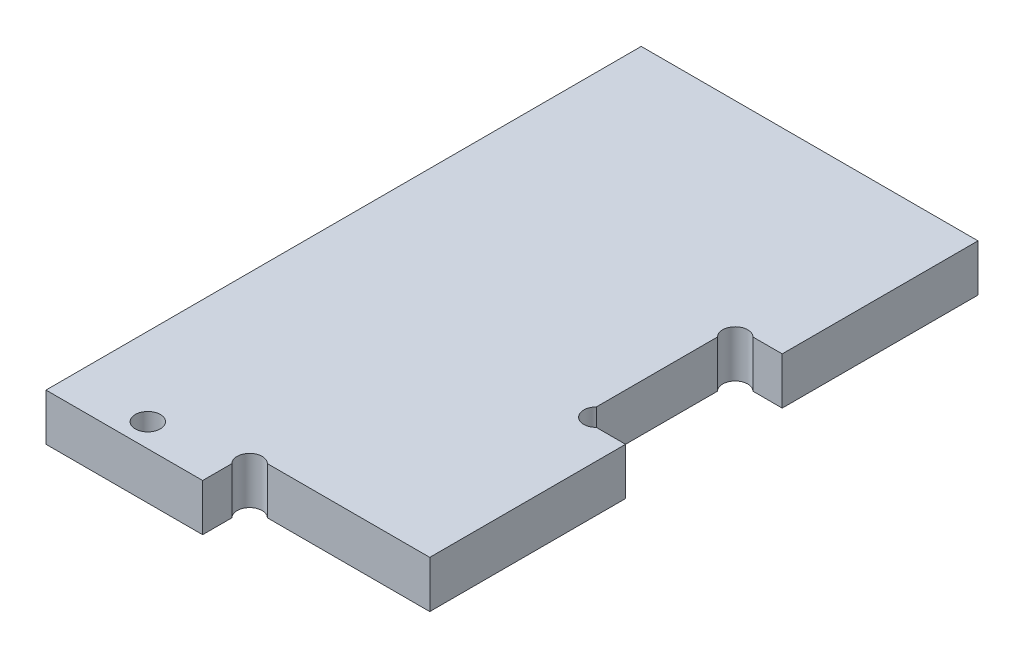
ISO-10303-21;
HEADER;
FILE_DESCRIPTION(('STEP AP214'),'2;1');
FILE_NAME('part.step','',(''),(''),'','','');
FILE_SCHEMA(('AUTOMOTIVE_DESIGN { 1 0 10303 214 1 1 1 1 }'));
ENDSEC;
DATA;
#1=APPLICATION_CONTEXT('core data for automotive mechanical design processes');
#2=APPLICATION_PROTOCOL_DEFINITION('international standard','automotive_design',2000,#1);
#3=PRODUCT_CONTEXT('',#1,'mechanical');
#4=PRODUCT('Part','Part','',(#3));
#5=PRODUCT_RELATED_PRODUCT_CATEGORY('part','',(#4));
#6=PRODUCT_DEFINITION_FORMATION('','',#4);
#7=PRODUCT_DEFINITION_CONTEXT('part definition',#1,'design');
#8=PRODUCT_DEFINITION('design','',#6,#7);
#9=PRODUCT_DEFINITION_SHAPE('','',#8);
#10=(LENGTH_UNIT() NAMED_UNIT(*) SI_UNIT(.MILLI.,.METRE.));
#11=(NAMED_UNIT(*) PLANE_ANGLE_UNIT() SI_UNIT($,.RADIAN.));
#12=(NAMED_UNIT(*) SI_UNIT($,.STERADIAN.) SOLID_ANGLE_UNIT());
#13=UNCERTAINTY_MEASURE_WITH_UNIT(LENGTH_MEASURE(1.E-05),#10,'distance_accuracy_value','');
#14=(GEOMETRIC_REPRESENTATION_CONTEXT(3) GLOBAL_UNCERTAINTY_ASSIGNED_CONTEXT((#13)) GLOBAL_UNIT_ASSIGNED_CONTEXT((#10,
#11,#12)) REPRESENTATION_CONTEXT('',''));
#15=CARTESIAN_POINT('',(0.,0.,0.));
#16=DIRECTION('',(0.,0.,1.));
#17=DIRECTION('',(1.,0.,0.));
#18=AXIS2_PLACEMENT_3D('',#15,#16,#17);
#19=CARTESIAN_POINT('',(21.1313708498985,6.,-4.86862915010154));
#20=DIRECTION('',(0.,1.,0.));
#21=DIRECTION('',(0.,0.,1.));
#22=AXIS2_PLACEMENT_3D('',#19,#20,#21);
#23=PLANE('',#22);
#24=CARTESIAN_POINT('',(21.1313708498985,6.,-4.86862915010154));
#25=DIRECTION('',(0.,-1.,0.));
#26=DIRECTION('',(0.,0.,1.));
#27=AXIS2_PLACEMENT_3D('',#24,#25,#26);
#28=CIRCLE('',#27,1.59999999999998);
#29=CARTESIAN_POINT('',(20.,6.,-3.73725830020308));
#30=VERTEX_POINT('',#29);
#31=CARTESIAN_POINT('',(22.2627416997969,6.,-5.99999999999999));
#32=VERTEX_POINT('',#31);
#33=EDGE_CURVE('E184',#30,#32,#28,.T.);
#34=ORIENTED_EDGE('',*,*,#33,.T.);
#35=DIRECTION('',(1.,0.,0.));
#36=VECTOR('',#35,1.);
#37=CARTESIAN_POINT('',(43.,6.,-5.99999999999999));
#38=LINE('',#37,#36);
#39=CARTESIAN_POINT('',(43.,6.,-5.99999999999999));
#40=VERTEX_POINT('',#39);
#41=EDGE_CURVE('E107',#32,#40,#38,.T.);
#42=ORIENTED_EDGE('',*,*,#41,.T.);
#43=DIRECTION('',(0.,0.,-1.));
#44=VECTOR('',#43,1.);
#45=CARTESIAN_POINT('',(43.,6.,-31.));
#46=LINE('',#45,#44);
#47=CARTESIAN_POINT('',(43.,6.,-31.));
#48=VERTEX_POINT('',#47);
#49=EDGE_CURVE('E214',#40,#48,#46,.T.);
#50=ORIENTED_EDGE('',*,*,#49,.T.);
#51=DIRECTION('',(-1.,0.,0.));
#52=VECTOR('',#51,1.);
#53=CARTESIAN_POINT('',(39.262741699797,6.,-31.));
#54=LINE('',#53,#52);
#55=CARTESIAN_POINT('',(39.262741699797,6.,-31.));
#56=VERTEX_POINT('',#55);
#57=EDGE_CURVE('E233',#48,#56,#54,.T.);
#58=ORIENTED_EDGE('',*,*,#57,.T.);
#59=CARTESIAN_POINT('',(38.1313708498985,6.,-32.1313708498985));
#60=DIRECTION('',(0.,-1.,0.));
#61=DIRECTION('',(0.,0.,1.));
#62=AXIS2_PLACEMENT_3D('',#59,#60,#61);
#63=CIRCLE('',#62,1.60000000000002);
#64=CARTESIAN_POINT('',(37.,6.,-33.2627416997969));
#65=VERTEX_POINT('',#64);
#66=EDGE_CURVE('E230',#56,#65,#63,.T.);
#67=ORIENTED_EDGE('',*,*,#66,.T.);
#68=DIRECTION('',(0.,0.,-1.));
#69=VECTOR('',#68,1.);
#70=CARTESIAN_POINT('',(37.,6.,-33.2627416997969));
#71=LINE('',#70,#69);
#72=CARTESIAN_POINT('',(37.,6.,-48.737258300203));
#73=VERTEX_POINT('',#72);
#74=EDGE_CURVE('E232',#65,#73,#71,.T.);
#75=ORIENTED_EDGE('',*,*,#74,.T.);
#76=CARTESIAN_POINT('',(38.1313708498985,6.,-49.8686291501015));
#77=DIRECTION('',(0.,-1.,0.));
#78=DIRECTION('',(0.,0.,-1.));
#79=AXIS2_PLACEMENT_3D('',#76,#77,#78);
#80=CIRCLE('',#79,1.60000000000002);
#81=CARTESIAN_POINT('',(39.262741699797,6.,-51.));
#82=VERTEX_POINT('',#81);
#83=EDGE_CURVE('E235',#73,#82,#80,.T.);
#84=ORIENTED_EDGE('',*,*,#83,.T.);
#85=DIRECTION('',(1.,0.,0.));
#86=VECTOR('',#85,1.);
#87=CARTESIAN_POINT('',(43.,6.,-51.));
#88=LINE('',#87,#86);
#89=CARTESIAN_POINT('',(43.,6.,-51.));
#90=VERTEX_POINT('',#89);
#91=EDGE_CURVE('E241',#82,#90,#88,.T.);
#92=ORIENTED_EDGE('',*,*,#91,.T.);
#93=DIRECTION('',(0.,0.,-1.));
#94=VECTOR('',#93,1.);
#95=CARTESIAN_POINT('',(43.,6.,-76.));
#96=LINE('',#95,#94);
#97=CARTESIAN_POINT('',(43.,6.,-76.));
#98=VERTEX_POINT('',#97);
#99=EDGE_CURVE('E243',#90,#98,#96,.T.);
#100=ORIENTED_EDGE('',*,*,#99,.T.);
#101=DIRECTION('',(-1.,0.,0.));
#102=VECTOR('',#101,1.);
#103=CARTESIAN_POINT('',(0.,6.,-76.));
#104=LINE('',#103,#102);
#105=CARTESIAN_POINT('',(0.,6.,-76.));
#106=VERTEX_POINT('',#105);
#107=EDGE_CURVE('E141',#98,#106,#104,.T.);
#108=ORIENTED_EDGE('',*,*,#107,.T.);
#109=DIRECTION('',(0.,0.,1.));
#110=VECTOR('',#109,1.);
#111=CARTESIAN_POINT('',(0.,6.,0.));
#112=LINE('',#111,#110);
#113=CARTESIAN_POINT('',(0.,6.,0.));
#114=VERTEX_POINT('',#113);
#115=EDGE_CURVE('E135',#106,#114,#112,.T.);
#116=ORIENTED_EDGE('',*,*,#115,.T.);
#117=DIRECTION('',(1.,0.,0.));
#118=VECTOR('',#117,1.);
#119=CARTESIAN_POINT('',(20.,6.,0.));
#120=LINE('',#119,#118);
#121=CARTESIAN_POINT('',(20.,6.,0.));
#122=VERTEX_POINT('',#121);
#123=EDGE_CURVE('E139',#114,#122,#120,.T.);
#124=ORIENTED_EDGE('',*,*,#123,.T.);
#125=DIRECTION('',(0.,0.,-1.));
#126=VECTOR('',#125,1.);
#127=CARTESIAN_POINT('',(20.,6.,-3.73725830020308));
#128=LINE('',#127,#126);
#129=EDGE_CURVE('E49',#122,#30,#128,.T.);
#130=ORIENTED_EDGE('',*,*,#129,.T.);
#131=EDGE_LOOP('',(#34,#42,#50,#58,#67,#75,#84,#92,#100,#108,#116,#124,#130));
#132=FACE_BOUND('',#131,.T.);
#133=CARTESIAN_POINT('',(10.,6.,-2.99999999999999));
#134=DIRECTION('',(0.,1.,0.));
#135=DIRECTION('',(0.,0.,1.));
#136=AXIS2_PLACEMENT_3D('',#133,#134,#135);
#137=CIRCLE('',#136,1.6);
#138=CARTESIAN_POINT('',(10.,6.,-1.39999999999999));
#139=VERTEX_POINT('',#138);
#140=EDGE_CURVE('E163',#139,#139,#137,.T.);
#141=ORIENTED_EDGE('',*,*,#140,.F.);
#142=EDGE_LOOP('',(#141));
#143=FACE_BOUND('',#142,.T.);
#144=ADVANCED_FACE('F32',(#132,#143),#23,.T.);
#145=CARTESIAN_POINT('',(21.1313708498985,0.,-4.86862915010154));
#146=DIRECTION('',(0.,1.,0.));
#147=DIRECTION('',(0.,0.,1.));
#148=AXIS2_PLACEMENT_3D('',#145,#146,#147);
#149=PLANE('',#148);
#150=CARTESIAN_POINT('',(21.1313708498985,0.,-4.86862915010154));
#151=DIRECTION('',(0.,-1.,0.));
#152=DIRECTION('',(0.,0.,1.));
#153=AXIS2_PLACEMENT_3D('',#150,#151,#152);
#154=CIRCLE('',#153,1.59999999999998);
#155=CARTESIAN_POINT('',(20.,0.,-3.73725830020308));
#156=VERTEX_POINT('',#155);
#157=CARTESIAN_POINT('',(22.2627416997969,0.,-5.99999999999999));
#158=VERTEX_POINT('',#157);
#159=EDGE_CURVE('E159',#156,#158,#154,.T.);
#160=ORIENTED_EDGE('',*,*,#159,.F.);
#161=DIRECTION('',(0.,0.,-1.));
#162=VECTOR('',#161,1.);
#163=CARTESIAN_POINT('',(20.,0.,-3.73725830020308));
#164=LINE('',#163,#162);
#165=CARTESIAN_POINT('',(20.,0.,0.));
#166=VERTEX_POINT('',#165);
#167=EDGE_CURVE('E99',#166,#156,#164,.T.);
#168=ORIENTED_EDGE('',*,*,#167,.F.);
#169=DIRECTION('',(1.,0.,0.));
#170=VECTOR('',#169,1.);
#171=CARTESIAN_POINT('',(20.,0.,0.));
#172=LINE('',#171,#170);
#173=CARTESIAN_POINT('',(0.,0.,0.));
#174=VERTEX_POINT('',#173);
#175=EDGE_CURVE('E93',#174,#166,#172,.T.);
#176=ORIENTED_EDGE('',*,*,#175,.F.);
#177=DIRECTION('',(0.,0.,1.));
#178=VECTOR('',#177,1.);
#179=CARTESIAN_POINT('',(0.,0.,0.));
#180=LINE('',#179,#178);
#181=CARTESIAN_POINT('',(0.,0.,-76.));
#182=VERTEX_POINT('',#181);
#183=EDGE_CURVE('E149',#182,#174,#180,.T.);
#184=ORIENTED_EDGE('',*,*,#183,.F.);
#185=DIRECTION('',(-1.,0.,0.));
#186=VECTOR('',#185,1.);
#187=CARTESIAN_POINT('',(0.,0.,-76.));
#188=LINE('',#187,#186);
#189=CARTESIAN_POINT('',(43.,0.,-76.));
#190=VERTEX_POINT('',#189);
#191=EDGE_CURVE('E179',#190,#182,#188,.T.);
#192=ORIENTED_EDGE('',*,*,#191,.F.);
#193=DIRECTION('',(0.,0.,-1.));
#194=VECTOR('',#193,1.);
#195=CARTESIAN_POINT('',(43.,0.,-76.));
#196=LINE('',#195,#194);
#197=CARTESIAN_POINT('',(43.,0.,-51.));
#198=VERTEX_POINT('',#197);
#199=EDGE_CURVE('E177',#198,#190,#196,.T.);
#200=ORIENTED_EDGE('',*,*,#199,.F.);
#201=DIRECTION('',(1.,0.,0.));
#202=VECTOR('',#201,1.);
#203=CARTESIAN_POINT('',(43.,0.,-51.));
#204=LINE('',#203,#202);
#205=CARTESIAN_POINT('',(39.262741699797,0.,-51.));
#206=VERTEX_POINT('',#205);
#207=EDGE_CURVE('E175',#206,#198,#204,.T.);
#208=ORIENTED_EDGE('',*,*,#207,.F.);
#209=CARTESIAN_POINT('',(38.1313708498985,0.,-49.8686291501015));
#210=DIRECTION('',(0.,-1.,0.));
#211=DIRECTION('',(0.,0.,-1.));
#212=AXIS2_PLACEMENT_3D('',#209,#210,#211);
#213=CIRCLE('',#212,1.60000000000002);
#214=CARTESIAN_POINT('',(37.,0.,-48.737258300203));
#215=VERTEX_POINT('',#214);
#216=EDGE_CURVE('E173',#215,#206,#213,.T.);
#217=ORIENTED_EDGE('',*,*,#216,.F.);
#218=DIRECTION('',(0.,0.,-1.));
#219=VECTOR('',#218,1.);
#220=CARTESIAN_POINT('',(37.,0.,-33.2627416997969));
#221=LINE('',#220,#219);
#222=CARTESIAN_POINT('',(37.,0.,-33.2627416997969));
#223=VERTEX_POINT('',#222);
#224=EDGE_CURVE('E171',#223,#215,#221,.T.);
#225=ORIENTED_EDGE('',*,*,#224,.F.);
#226=CARTESIAN_POINT('',(38.1313708498985,0.,-32.1313708498985));
#227=DIRECTION('',(0.,-1.,0.));
#228=DIRECTION('',(0.,0.,1.));
#229=AXIS2_PLACEMENT_3D('',#226,#227,#228);
#230=CIRCLE('',#229,1.60000000000002);
#231=CARTESIAN_POINT('',(39.262741699797,0.,-31.));
#232=VERTEX_POINT('',#231);
#233=EDGE_CURVE('E169',#232,#223,#230,.T.);
#234=ORIENTED_EDGE('',*,*,#233,.F.);
#235=DIRECTION('',(-1.,0.,0.));
#236=VECTOR('',#235,1.);
#237=CARTESIAN_POINT('',(39.262741699797,0.,-31.));
#238=LINE('',#237,#236);
#239=CARTESIAN_POINT('',(43.,0.,-31.));
#240=VERTEX_POINT('',#239);
#241=EDGE_CURVE('E167',#240,#232,#238,.T.);
#242=ORIENTED_EDGE('',*,*,#241,.F.);
#243=DIRECTION('',(0.,0.,-1.));
#244=VECTOR('',#243,1.);
#245=CARTESIAN_POINT('',(43.,0.,-31.));
#246=LINE('',#245,#244);
#247=CARTESIAN_POINT('',(43.,0.,-5.99999999999999));
#248=VERTEX_POINT('',#247);
#249=EDGE_CURVE('E165',#248,#240,#246,.T.);
#250=ORIENTED_EDGE('',*,*,#249,.F.);
#251=DIRECTION('',(1.,0.,0.));
#252=VECTOR('',#251,1.);
#253=CARTESIAN_POINT('',(43.,0.,-5.99999999999999));
#254=LINE('',#253,#252);
#255=EDGE_CURVE('E162',#158,#248,#254,.T.);
#256=ORIENTED_EDGE('',*,*,#255,.F.);
#257=EDGE_LOOP('',(#160,#168,#176,#184,#192,#200,#208,#217,#225,#234,#242,#250,#256));
#258=FACE_BOUND('',#257,.T.);
#259=CARTESIAN_POINT('',(10.,0.,-2.99999999999999));
#260=DIRECTION('',(0.,1.,0.));
#261=DIRECTION('',(0.,0.,1.));
#262=AXIS2_PLACEMENT_3D('',#259,#260,#261);
#263=CIRCLE('',#262,1.6);
#264=CARTESIAN_POINT('',(10.,0.,-1.39999999999999));
#265=VERTEX_POINT('',#264);
#266=EDGE_CURVE('E403',#265,#265,#263,.T.);
#267=ORIENTED_EDGE('',*,*,#266,.T.);
#268=EDGE_LOOP('',(#267));
#269=FACE_BOUND('',#268,.T.);
#270=ADVANCED_FACE('F218',(#258,#269),#149,.F.);
#271=CARTESIAN_POINT('',(21.1313708498985,6.,-4.86862915010154));
#272=DIRECTION('',(0.,-1.,0.));
#273=DIRECTION('',(0.,0.,-1.));
#274=AXIS2_PLACEMENT_3D('',#271,#272,#273);
#275=CYLINDRICAL_SURFACE('',#274,1.59999999999998);
#276=ORIENTED_EDGE('',*,*,#159,.T.);
#277=DIRECTION('',(0.,-1.,0.));
#278=VECTOR('',#277,1.);
#279=CARTESIAN_POINT('',(22.2627416997969,6.,-5.99999999999999));
#280=LINE('',#279,#278);
#281=EDGE_CURVE('E11',#32,#158,#280,.T.);
#282=ORIENTED_EDGE('',*,*,#281,.F.);
#283=ORIENTED_EDGE('',*,*,#33,.F.);
#284=DIRECTION('',(0.,-1.,0.));
#285=VECTOR('',#284,1.);
#286=CARTESIAN_POINT('',(20.,6.,-3.73725830020308));
#287=LINE('',#286,#285);
#288=EDGE_CURVE('E155',#30,#156,#287,.T.);
#289=ORIENTED_EDGE('',*,*,#288,.T.);
#290=EDGE_LOOP('',(#276,#282,#283,#289));
#291=FACE_BOUND('',#290,.T.);
#292=ADVANCED_FACE('F34',(#291),#275,.F.);
#293=CARTESIAN_POINT('',(43.,6.,-5.99999999999999));
#294=DIRECTION('',(0.,0.,-1.));
#295=DIRECTION('',(-1.,0.,0.));
#296=AXIS2_PLACEMENT_3D('',#293,#294,#295);
#297=PLANE('',#296);
#298=ORIENTED_EDGE('',*,*,#255,.T.);
#299=DIRECTION('',(0.,-1.,0.));
#300=VECTOR('',#299,1.);
#301=CARTESIAN_POINT('',(43.,6.,-5.99999999999999));
#302=LINE('',#301,#300);
#303=EDGE_CURVE('E41',#40,#248,#302,.T.);
#304=ORIENTED_EDGE('',*,*,#303,.F.);
#305=ORIENTED_EDGE('',*,*,#41,.F.);
#306=ORIENTED_EDGE('',*,*,#281,.T.);
#307=EDGE_LOOP('',(#298,#304,#305,#306));
#308=FACE_BOUND('',#307,.T.);
#309=ADVANCED_FACE('F277',(#308),#297,.F.);
#310=CARTESIAN_POINT('',(43.,6.,-31.));
#311=DIRECTION('',(-1.,0.,0.));
#312=DIRECTION('',(0.,0.,1.));
#313=AXIS2_PLACEMENT_3D('',#310,#311,#312);
#314=PLANE('',#313);
#315=ORIENTED_EDGE('',*,*,#249,.T.);
#316=DIRECTION('',(0.,-1.,0.));
#317=VECTOR('',#316,1.);
#318=CARTESIAN_POINT('',(43.,6.,-31.));
#319=LINE('',#318,#317);
#320=EDGE_CURVE('E206',#48,#240,#319,.T.);
#321=ORIENTED_EDGE('',*,*,#320,.F.);
#322=ORIENTED_EDGE('',*,*,#49,.F.);
#323=ORIENTED_EDGE('',*,*,#303,.T.);
#324=EDGE_LOOP('',(#315,#321,#322,#323));
#325=FACE_BOUND('',#324,.T.);
#326=ADVANCED_FACE('F212',(#325),#314,.F.);
#327=CARTESIAN_POINT('',(39.262741699797,6.,-31.));
#328=DIRECTION('',(0.,0.,1.));
#329=DIRECTION('',(1.,0.,0.));
#330=AXIS2_PLACEMENT_3D('',#327,#328,#329);
#331=PLANE('',#330);
#332=ORIENTED_EDGE('',*,*,#241,.T.);
#333=DIRECTION('',(0.,-1.,0.));
#334=VECTOR('',#333,1.);
#335=CARTESIAN_POINT('',(39.262741699797,6.,-31.));
#336=LINE('',#335,#334);
#337=EDGE_CURVE('E203',#56,#232,#336,.T.);
#338=ORIENTED_EDGE('',*,*,#337,.F.);
#339=ORIENTED_EDGE('',*,*,#57,.F.);
#340=ORIENTED_EDGE('',*,*,#320,.T.);
#341=EDGE_LOOP('',(#332,#338,#339,#340));
#342=FACE_BOUND('',#341,.T.);
#343=ADVANCED_FACE('F224',(#342),#331,.F.);
#344=CARTESIAN_POINT('',(38.1313708498985,6.,-32.1313708498985));
#345=DIRECTION('',(0.,-1.,0.));
#346=DIRECTION('',(0.,0.,-1.));
#347=AXIS2_PLACEMENT_3D('',#344,#345,#346);
#348=CYLINDRICAL_SURFACE('',#347,1.60000000000002);
#349=ORIENTED_EDGE('',*,*,#233,.T.);
#350=DIRECTION('',(0.,-1.,0.));
#351=VECTOR('',#350,1.);
#352=CARTESIAN_POINT('',(37.,6.,-33.2627416997969));
#353=LINE('',#352,#351);
#354=EDGE_CURVE('E200',#65,#223,#353,.T.);
#355=ORIENTED_EDGE('',*,*,#354,.F.);
#356=ORIENTED_EDGE('',*,*,#66,.F.);
#357=ORIENTED_EDGE('',*,*,#337,.T.);
#358=EDGE_LOOP('',(#349,#355,#356,#357));
#359=FACE_BOUND('',#358,.T.);
#360=ADVANCED_FACE('F228',(#359),#348,.F.);
#361=CARTESIAN_POINT('',(37.,6.,-33.2627416997969));
#362=DIRECTION('',(-1.,0.,0.));
#363=DIRECTION('',(0.,0.,1.));
#364=AXIS2_PLACEMENT_3D('',#361,#362,#363);
#365=PLANE('',#364);
#366=ORIENTED_EDGE('',*,*,#224,.T.);
#367=DIRECTION('',(0.,-1.,0.));
#368=VECTOR('',#367,1.);
#369=CARTESIAN_POINT('',(37.,6.,-48.737258300203));
#370=LINE('',#369,#368);
#371=EDGE_CURVE('E197',#73,#215,#370,.T.);
#372=ORIENTED_EDGE('',*,*,#371,.F.);
#373=ORIENTED_EDGE('',*,*,#74,.F.);
#374=ORIENTED_EDGE('',*,*,#354,.T.);
#375=EDGE_LOOP('',(#366,#372,#373,#374));
#376=FACE_BOUND('',#375,.T.);
#377=ADVANCED_FACE('F290',(#376),#365,.F.);
#378=CARTESIAN_POINT('',(38.1313708498985,6.,-49.8686291501015));
#379=DIRECTION('',(0.,-1.,0.));
#380=DIRECTION('',(0.,0.,-1.));
#381=AXIS2_PLACEMENT_3D('',#378,#379,#380);
#382=CYLINDRICAL_SURFACE('',#381,1.60000000000002);
#383=ORIENTED_EDGE('',*,*,#216,.T.);
#384=DIRECTION('',(0.,-1.,0.));
#385=VECTOR('',#384,1.);
#386=CARTESIAN_POINT('',(39.262741699797,6.,-51.));
#387=LINE('',#386,#385);
#388=EDGE_CURVE('E194',#82,#206,#387,.T.);
#389=ORIENTED_EDGE('',*,*,#388,.F.);
#390=ORIENTED_EDGE('',*,*,#83,.F.);
#391=ORIENTED_EDGE('',*,*,#371,.T.);
#392=EDGE_LOOP('',(#383,#389,#390,#391));
#393=FACE_BOUND('',#392,.T.);
#394=ADVANCED_FACE('F293',(#393),#382,.F.);
#395=CARTESIAN_POINT('',(43.,6.,-51.));
#396=DIRECTION('',(0.,0.,-1.));
#397=DIRECTION('',(-1.,0.,0.));
#398=AXIS2_PLACEMENT_3D('',#395,#396,#397);
#399=PLANE('',#398);
#400=ORIENTED_EDGE('',*,*,#207,.T.);
#401=DIRECTION('',(0.,-1.,0.));
#402=VECTOR('',#401,1.);
#403=CARTESIAN_POINT('',(43.,6.,-51.));
#404=LINE('',#403,#402);
#405=EDGE_CURVE('E191',#90,#198,#404,.T.);
#406=ORIENTED_EDGE('',*,*,#405,.F.);
#407=ORIENTED_EDGE('',*,*,#91,.F.);
#408=ORIENTED_EDGE('',*,*,#388,.T.);
#409=EDGE_LOOP('',(#400,#406,#407,#408));
#410=FACE_BOUND('',#409,.T.);
#411=ADVANCED_FACE('F297',(#410),#399,.F.);
#412=CARTESIAN_POINT('',(43.,6.,-76.));
#413=DIRECTION('',(-1.,0.,0.));
#414=DIRECTION('',(0.,0.,1.));
#415=AXIS2_PLACEMENT_3D('',#412,#413,#414);
#416=PLANE('',#415);
#417=ORIENTED_EDGE('',*,*,#199,.T.);
#418=DIRECTION('',(0.,-1.,0.));
#419=VECTOR('',#418,1.);
#420=CARTESIAN_POINT('',(43.,6.,-76.));
#421=LINE('',#420,#419);
#422=EDGE_CURVE('E188',#98,#190,#421,.T.);
#423=ORIENTED_EDGE('',*,*,#422,.F.);
#424=ORIENTED_EDGE('',*,*,#99,.F.);
#425=ORIENTED_EDGE('',*,*,#405,.T.);
#426=EDGE_LOOP('',(#417,#423,#424,#425));
#427=FACE_BOUND('',#426,.T.);
#428=ADVANCED_FACE('F249',(#427),#416,.F.);
#429=CARTESIAN_POINT('',(0.,6.,-76.));
#430=DIRECTION('',(0.,0.,1.));
#431=DIRECTION('',(1.,0.,0.));
#432=AXIS2_PLACEMENT_3D('',#429,#430,#431);
#433=PLANE('',#432);
#434=ORIENTED_EDGE('',*,*,#191,.T.);
#435=DIRECTION('',(0.,-1.,0.));
#436=VECTOR('',#435,1.);
#437=CARTESIAN_POINT('',(0.,6.,-76.));
#438=LINE('',#437,#436);
#439=EDGE_CURVE('E150',#106,#182,#438,.T.);
#440=ORIENTED_EDGE('',*,*,#439,.F.);
#441=ORIENTED_EDGE('',*,*,#107,.F.);
#442=ORIENTED_EDGE('',*,*,#422,.T.);
#443=EDGE_LOOP('',(#434,#440,#441,#442));
#444=FACE_BOUND('',#443,.T.);
#445=ADVANCED_FACE('F253',(#444),#433,.F.);
#446=CARTESIAN_POINT('',(0.,6.,0.));
#447=DIRECTION('',(1.,0.,0.));
#448=DIRECTION('',(0.,0.,-1.));
#449=AXIS2_PLACEMENT_3D('',#446,#447,#448);
#450=PLANE('',#449);
#451=ORIENTED_EDGE('',*,*,#183,.T.);
#452=DIRECTION('',(0.,-1.,0.));
#453=VECTOR('',#452,1.);
#454=CARTESIAN_POINT('',(0.,6.,0.));
#455=LINE('',#454,#453);
#456=EDGE_CURVE('E146',#114,#174,#455,.T.);
#457=ORIENTED_EDGE('',*,*,#456,.F.);
#458=ORIENTED_EDGE('',*,*,#115,.F.);
#459=ORIENTED_EDGE('',*,*,#439,.T.);
#460=EDGE_LOOP('',(#451,#457,#458,#459));
#461=FACE_BOUND('',#460,.T.);
#462=ADVANCED_FACE('F147',(#461),#450,.F.);
#463=CARTESIAN_POINT('',(20.,6.,0.));
#464=DIRECTION('',(0.,0.,-1.));
#465=DIRECTION('',(-1.,0.,0.));
#466=AXIS2_PLACEMENT_3D('',#463,#464,#465);
#467=PLANE('',#466);
#468=ORIENTED_EDGE('',*,*,#175,.T.);
#469=DIRECTION('',(0.,-1.,0.));
#470=VECTOR('',#469,1.);
#471=CARTESIAN_POINT('',(20.,6.,0.));
#472=LINE('',#471,#470);
#473=EDGE_CURVE('E151',#122,#166,#472,.T.);
#474=ORIENTED_EDGE('',*,*,#473,.F.);
#475=ORIENTED_EDGE('',*,*,#123,.F.);
#476=ORIENTED_EDGE('',*,*,#456,.T.);
#477=EDGE_LOOP('',(#468,#474,#475,#476));
#478=FACE_BOUND('',#477,.T.);
#479=ADVANCED_FACE('F153',(#478),#467,.F.);
#480=CARTESIAN_POINT('',(20.,6.,-3.73725830020308));
#481=DIRECTION('',(-1.,0.,0.));
#482=DIRECTION('',(0.,0.,1.));
#483=AXIS2_PLACEMENT_3D('',#480,#481,#482);
#484=PLANE('',#483);
#485=ORIENTED_EDGE('',*,*,#167,.T.);
#486=ORIENTED_EDGE('',*,*,#288,.F.);
#487=ORIENTED_EDGE('',*,*,#129,.F.);
#488=ORIENTED_EDGE('',*,*,#473,.T.);
#489=EDGE_LOOP('',(#485,#486,#487,#488));
#490=FACE_BOUND('',#489,.T.);
#491=ADVANCED_FACE('F257',(#490),#484,.F.);
#492=CARTESIAN_POINT('',(10.,6.,-2.99999999999999));
#493=DIRECTION('',(0.,-1.,0.));
#494=DIRECTION('',(0.,0.,-1.));
#495=AXIS2_PLACEMENT_3D('',#492,#493,#494);
#496=CYLINDRICAL_SURFACE('',#495,1.6);
#497=ORIENTED_EDGE('',*,*,#140,.T.);
#498=EDGE_LOOP('',(#497));
#499=FACE_BOUND('',#498,.T.);
#500=ORIENTED_EDGE('',*,*,#266,.F.);
#501=EDGE_LOOP('',(#500));
#502=FACE_BOUND('',#501,.T.);
#503=ADVANCED_FACE('F259',(#499,#502),#496,.F.);
#504=CLOSED_SHELL('',(#144,#270,#292,#309,#326,#343,#360,#377,#394,#411,#428,#445,#462,#479,
#491,#503));
#505=MANIFOLD_SOLID_BREP('B2',#504);
#506=ADVANCED_BREP_SHAPE_REPRESENTATION('',(#18,#505),#14);
#507=SHAPE_DEFINITION_REPRESENTATION(#9,#506);
ENDSEC;
END-ISO-10303-21;
